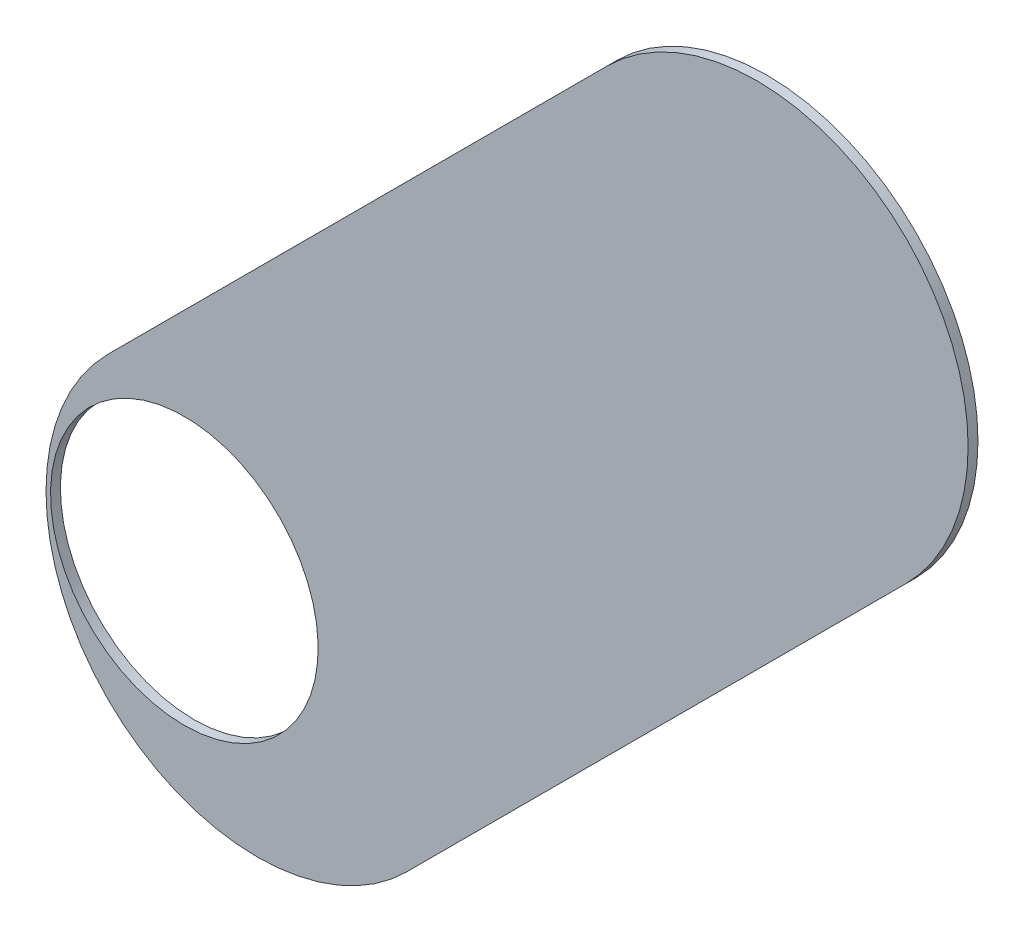
ISO-10303-21;
HEADER;
FILE_DESCRIPTION(('STEP AP214'),'2;1');
FILE_NAME('part.step','',(''),(''),'','','');
FILE_SCHEMA(('AUTOMOTIVE_DESIGN { 1 0 10303 214 1 1 1 1 }'));
ENDSEC;
DATA;
#1=APPLICATION_CONTEXT('core data for automotive mechanical design processes');
#2=APPLICATION_PROTOCOL_DEFINITION('international standard','automotive_design',2000,#1);
#3=PRODUCT_CONTEXT('',#1,'mechanical');
#4=PRODUCT('Part','Part','',(#3));
#5=PRODUCT_RELATED_PRODUCT_CATEGORY('part','',(#4));
#6=PRODUCT_DEFINITION_FORMATION('','',#4);
#7=PRODUCT_DEFINITION_CONTEXT('part definition',#1,'design');
#8=PRODUCT_DEFINITION('design','',#6,#7);
#9=PRODUCT_DEFINITION_SHAPE('','',#8);
#10=(LENGTH_UNIT() NAMED_UNIT(*) SI_UNIT(.MILLI.,.METRE.));
#11=(NAMED_UNIT(*) PLANE_ANGLE_UNIT() SI_UNIT($,.RADIAN.));
#12=(NAMED_UNIT(*) SI_UNIT($,.STERADIAN.) SOLID_ANGLE_UNIT());
#13=UNCERTAINTY_MEASURE_WITH_UNIT(LENGTH_MEASURE(1.E-05),#10,'distance_accuracy_value','');
#14=(GEOMETRIC_REPRESENTATION_CONTEXT(3) GLOBAL_UNCERTAINTY_ASSIGNED_CONTEXT((#13)) GLOBAL_UNIT_ASSIGNED_CONTEXT((#10,
#11,#12)) REPRESENTATION_CONTEXT('',''));
#15=CARTESIAN_POINT('',(0.,0.,0.));
#16=DIRECTION('',(0.,0.,1.));
#17=DIRECTION('',(1.,0.,0.));
#18=AXIS2_PLACEMENT_3D('',#15,#16,#17);
#19=CARTESIAN_POINT('',(113.792,-122.169,-0.045));
#20=DIRECTION('',(0.,0.,-1.));
#21=DIRECTION('',(0.,-1.,0.));
#22=AXIS2_PLACEMENT_3D('',#19,#20,#21);
#23=CYLINDRICAL_SURFACE('',#22,0.475);
#24=CARTESIAN_POINT('',(113.792,-122.169,-0.035));
#25=DIRECTION('',(0.,0.,-1.));
#26=DIRECTION('',(0.,-1.,0.));
#27=AXIS2_PLACEMENT_3D('',#24,#25,#26);
#28=CIRCLE('',#27,0.475);
#29=CARTESIAN_POINT('',(113.792,-122.644,-0.035));
#30=VERTEX_POINT('',#29);
#31=EDGE_CURVE('E129',#30,#30,#28,.T.);
#32=ORIENTED_EDGE('',*,*,#31,.T.);
#33=DIRECTION('',(0.,0.,1.));
#34=VECTOR('',#33,1.);
#35=CARTESIAN_POINT('',(113.792,-122.644,-0.045));
#36=LINE('',#35,#34);
#37=CARTESIAN_POINT('',(113.792,-122.644,0.));
#38=VERTEX_POINT('',#37);
#39=EDGE_CURVE('E11',#30,#38,#36,.T.);
#40=ORIENTED_EDGE('',*,*,#39,.T.);
#41=CARTESIAN_POINT('',(113.792,-122.169,0.));
#42=DIRECTION('',(0.,0.,-1.));
#43=DIRECTION('',(0.,-1.,0.));
#44=AXIS2_PLACEMENT_3D('',#41,#42,#43);
#45=CIRCLE('',#44,0.475);
#46=EDGE_CURVE('E26',#38,#38,#45,.T.);
#47=ORIENTED_EDGE('',*,*,#46,.F.);
#48=ORIENTED_EDGE('',*,*,#39,.F.);
#49=EDGE_LOOP('',(#32,#40,#47,#48));
#50=FACE_BOUND('',#49,.T.);
#51=ADVANCED_FACE('F17',(#50),#23,.F.);
#52=CARTESIAN_POINT('',(115.293669,-119.865669,-0.035));
#53=DIRECTION('',(0.707106781186548,-0.707106781186548,0.));
#54=DIRECTION('',(0.,0.,-1.));
#55=AXIS2_PLACEMENT_3D('',#52,#53,#54);
#56=PLANE('',#55);
#57=DIRECTION('',(-0.707106781186548,-0.707106781186548,0.));
#58=VECTOR('',#57,1.);
#59=CARTESIAN_POINT('',(115.293669,-119.865669,-0.035));
#60=LINE('',#59,#58);
#61=CARTESIAN_POINT('',(115.293669,-119.865669,-0.035));
#62=VERTEX_POINT('',#61);
#63=CARTESIAN_POINT('',(113.520669,-121.638669,-0.035));
#64=VERTEX_POINT('',#63);
#65=EDGE_CURVE('E56',#62,#64,#60,.T.);
#66=ORIENTED_EDGE('',*,*,#65,.T.);
#67=DIRECTION('',(0.,0.,1.));
#68=VECTOR('',#67,1.);
#69=CARTESIAN_POINT('',(113.520669,-121.638669,-0.035));
#70=LINE('',#69,#68);
#71=CARTESIAN_POINT('',(113.520669,-121.638669,0.));
#72=VERTEX_POINT('',#71);
#73=EDGE_CURVE('E94',#64,#72,#70,.T.);
#74=ORIENTED_EDGE('',*,*,#73,.T.);
#75=DIRECTION('',(-0.707106781186548,-0.707106781186548,0.));
#76=VECTOR('',#75,1.);
#77=CARTESIAN_POINT('',(115.293669,-119.865669,0.));
#78=LINE('',#77,#76);
#79=CARTESIAN_POINT('',(115.293669,-119.865669,0.));
#80=VERTEX_POINT('',#79);
#81=EDGE_CURVE('E65',#80,#72,#78,.T.);
#82=ORIENTED_EDGE('',*,*,#81,.F.);
#83=DIRECTION('',(0.,0.,1.));
#84=VECTOR('',#83,1.);
#85=CARTESIAN_POINT('',(115.293669,-119.865669,-0.035));
#86=LINE('',#85,#84);
#87=EDGE_CURVE('E124',#62,#80,#86,.T.);
#88=ORIENTED_EDGE('',*,*,#87,.F.);
#89=EDGE_LOOP('',(#66,#74,#82,#88));
#90=FACE_BOUND('',#89,.T.);
#91=ADVANCED_FACE('F19',(#90),#56,.F.);
#92=CARTESIAN_POINT('',(114.58133,-122.69933,0.));
#93=DIRECTION('',(0.,0.,1.));
#94=DIRECTION('',(1.,0.,0.));
#95=AXIS2_PLACEMENT_3D('',#92,#93,#94);
#96=PLANE('',#95);
#97=ORIENTED_EDGE('',*,*,#46,.T.);
#98=EDGE_LOOP('',(#97));
#99=FACE_BOUND('',#98,.T.);
#100=DIRECTION('',(0.707106781186548,0.707106781186548,0.));
#101=VECTOR('',#100,1.);
#102=CARTESIAN_POINT('',(114.58133,-122.69933,0.));
#103=LINE('',#102,#101);
#104=CARTESIAN_POINT('',(114.58133,-122.69933,0.));
#105=VERTEX_POINT('',#104);
#106=CARTESIAN_POINT('',(116.35433,-120.92633,0.));
#107=VERTEX_POINT('',#106);
#108=EDGE_CURVE('E105',#105,#107,#103,.T.);
#109=ORIENTED_EDGE('',*,*,#108,.T.);
#110=CARTESIAN_POINT('',(115.8239995,-120.3959995,0.));
#111=DIRECTION('',(0.,0.,1.));
#112=DIRECTION('',(0.707106781186548,-0.707106781186548,0.));
#113=AXIS2_PLACEMENT_3D('',#110,#111,#112);
#114=CIRCLE('',#113,0.75000058564);
#115=EDGE_CURVE('E132',#107,#80,#114,.T.);
#116=ORIENTED_EDGE('',*,*,#115,.T.);
#117=ORIENTED_EDGE('',*,*,#81,.T.);
#118=CARTESIAN_POINT('',(114.0509995,-122.1689995,0.));
#119=DIRECTION('',(0.,0.,1.));
#120=DIRECTION('',(-0.707106781186548,0.707106781186548,0.));
#121=AXIS2_PLACEMENT_3D('',#118,#119,#120);
#122=CIRCLE('',#121,0.75000058564);
#123=EDGE_CURVE('E97',#72,#105,#122,.T.);
#124=ORIENTED_EDGE('',*,*,#123,.T.);
#125=EDGE_LOOP('',(#109,#116,#117,#124));
#126=FACE_BOUND('',#125,.T.);
#127=ADVANCED_FACE('F223',(#99,#126),#96,.T.);
#128=CARTESIAN_POINT('',(114.58133,-122.69933,-0.035));
#129=DIRECTION('',(0.,0.,1.));
#130=DIRECTION('',(1.,0.,0.));
#131=AXIS2_PLACEMENT_3D('',#128,#129,#130);
#132=PLANE('',#131);
#133=ORIENTED_EDGE('',*,*,#31,.F.);
#134=EDGE_LOOP('',(#133));
#135=FACE_BOUND('',#134,.T.);
#136=CARTESIAN_POINT('',(114.0509995,-122.1689995,-0.035));
#137=DIRECTION('',(0.,0.,1.));
#138=DIRECTION('',(-0.707106781186548,0.707106781186548,0.));
#139=AXIS2_PLACEMENT_3D('',#136,#137,#138);
#140=CIRCLE('',#139,0.75000058564);
#141=CARTESIAN_POINT('',(114.58133,-122.69933,-0.035));
#142=VERTEX_POINT('',#141);
#143=EDGE_CURVE('E88',#64,#142,#140,.T.);
#144=ORIENTED_EDGE('',*,*,#143,.F.);
#145=ORIENTED_EDGE('',*,*,#65,.F.);
#146=CARTESIAN_POINT('',(115.8239995,-120.3959995,-0.035));
#147=DIRECTION('',(0.,0.,1.));
#148=DIRECTION('',(0.707106781186548,-0.707106781186548,0.));
#149=AXIS2_PLACEMENT_3D('',#146,#147,#148);
#150=CIRCLE('',#149,0.75000058564);
#151=CARTESIAN_POINT('',(116.35433,-120.92633,-0.035));
#152=VERTEX_POINT('',#151);
#153=EDGE_CURVE('E110',#152,#62,#150,.T.);
#154=ORIENTED_EDGE('',*,*,#153,.F.);
#155=DIRECTION('',(0.707106781186548,0.707106781186548,0.));
#156=VECTOR('',#155,1.);
#157=CARTESIAN_POINT('',(114.58133,-122.69933,-0.035));
#158=LINE('',#157,#156);
#159=EDGE_CURVE('E103',#142,#152,#158,.T.);
#160=ORIENTED_EDGE('',*,*,#159,.F.);
#161=EDGE_LOOP('',(#144,#145,#154,#160));
#162=FACE_BOUND('',#161,.T.);
#163=ADVANCED_FACE('F108',(#135,#162),#132,.F.);
#164=CARTESIAN_POINT('',(115.8239995,-120.3959995,-0.035));
#165=DIRECTION('',(0.,0.,-1.));
#166=DIRECTION('',(0.707106781186548,-0.707106781186548,0.));
#167=AXIS2_PLACEMENT_3D('',#164,#165,#166);
#168=CYLINDRICAL_SURFACE('',#167,0.75000058564);
#169=ORIENTED_EDGE('',*,*,#153,.T.);
#170=ORIENTED_EDGE('',*,*,#87,.T.);
#171=ORIENTED_EDGE('',*,*,#115,.F.);
#172=DIRECTION('',(0.,0.,1.));
#173=VECTOR('',#172,1.);
#174=CARTESIAN_POINT('',(116.35433,-120.92633,-0.035));
#175=LINE('',#174,#173);
#176=EDGE_CURVE('E113',#152,#107,#175,.T.);
#177=ORIENTED_EDGE('',*,*,#176,.F.);
#178=EDGE_LOOP('',(#169,#170,#171,#177));
#179=FACE_BOUND('',#178,.T.);
#180=ADVANCED_FACE('F204',(#179),#168,.T.);
#181=CARTESIAN_POINT('',(114.0509995,-122.1689995,-0.035));
#182=DIRECTION('',(0.,0.,-1.));
#183=DIRECTION('',(-0.707106781186548,0.707106781186548,0.));
#184=AXIS2_PLACEMENT_3D('',#181,#182,#183);
#185=CYLINDRICAL_SURFACE('',#184,0.75000058564);
#186=ORIENTED_EDGE('',*,*,#143,.T.);
#187=DIRECTION('',(0.,0.,1.));
#188=VECTOR('',#187,1.);
#189=CARTESIAN_POINT('',(114.58133,-122.69933,-0.035));
#190=LINE('',#189,#188);
#191=EDGE_CURVE('E92',#142,#105,#190,.T.);
#192=ORIENTED_EDGE('',*,*,#191,.T.);
#193=ORIENTED_EDGE('',*,*,#123,.F.);
#194=ORIENTED_EDGE('',*,*,#73,.F.);
#195=EDGE_LOOP('',(#186,#192,#193,#194));
#196=FACE_BOUND('',#195,.T.);
#197=ADVANCED_FACE('F90',(#196),#185,.T.);
#198=CARTESIAN_POINT('',(114.58133,-122.69933,-0.035));
#199=DIRECTION('',(-0.707106781186548,0.707106781186548,0.));
#200=DIRECTION('',(0.,0.,1.));
#201=AXIS2_PLACEMENT_3D('',#198,#199,#200);
#202=PLANE('',#201);
#203=ORIENTED_EDGE('',*,*,#159,.T.);
#204=ORIENTED_EDGE('',*,*,#176,.T.);
#205=ORIENTED_EDGE('',*,*,#108,.F.);
#206=ORIENTED_EDGE('',*,*,#191,.F.);
#207=EDGE_LOOP('',(#203,#204,#205,#206));
#208=FACE_BOUND('',#207,.T.);
#209=ADVANCED_FACE('F101',(#208),#202,.F.);
#210=CLOSED_SHELL('',(#51,#91,#127,#163,#180,#197,#209));
#211=MANIFOLD_SOLID_BREP('B1',#210);
#212=ADVANCED_BREP_SHAPE_REPRESENTATION('',(#18,#211),#14);
#213=SHAPE_DEFINITION_REPRESENTATION(#9,#212);
ENDSEC;
END-ISO-10303-21;
